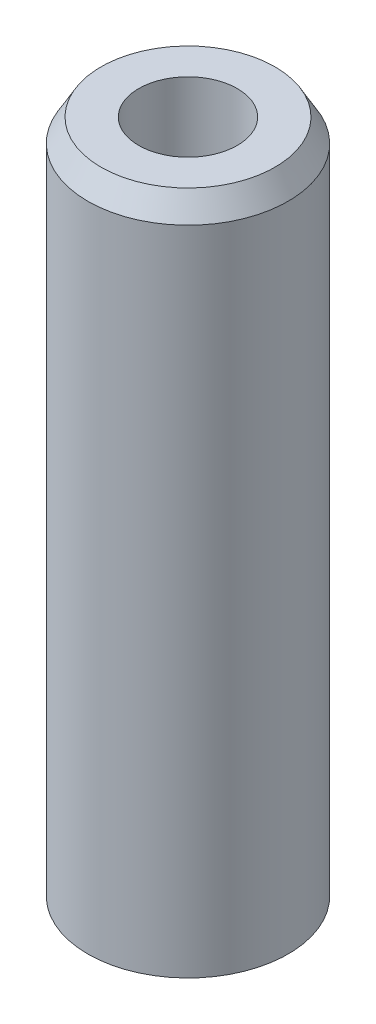
ISO-10303-21;
HEADER;
FILE_DESCRIPTION(('STEP AP214'),'2;1');
FILE_NAME('part.step','',(''),(''),'','','');
FILE_SCHEMA(('AUTOMOTIVE_DESIGN { 1 0 10303 214 1 1 1 1 }'));
ENDSEC;
DATA;
#1=APPLICATION_CONTEXT('core data for automotive mechanical design processes');
#2=APPLICATION_PROTOCOL_DEFINITION('international standard','automotive_design',2000,#1);
#3=PRODUCT_CONTEXT('',#1,'mechanical');
#4=PRODUCT('Part','Part','',(#3));
#5=PRODUCT_RELATED_PRODUCT_CATEGORY('part','',(#4));
#6=PRODUCT_DEFINITION_FORMATION('','',#4);
#7=PRODUCT_DEFINITION_CONTEXT('part definition',#1,'design');
#8=PRODUCT_DEFINITION('design','',#6,#7);
#9=PRODUCT_DEFINITION_SHAPE('','',#8);
#10=(LENGTH_UNIT() NAMED_UNIT(*) SI_UNIT(.MILLI.,.METRE.));
#11=(NAMED_UNIT(*) PLANE_ANGLE_UNIT() SI_UNIT($,.RADIAN.));
#12=(NAMED_UNIT(*) SI_UNIT($,.STERADIAN.) SOLID_ANGLE_UNIT());
#13=UNCERTAINTY_MEASURE_WITH_UNIT(LENGTH_MEASURE(1.E-05),#10,'distance_accuracy_value','');
#14=(GEOMETRIC_REPRESENTATION_CONTEXT(3) GLOBAL_UNCERTAINTY_ASSIGNED_CONTEXT((#13)) GLOBAL_UNIT_ASSIGNED_CONTEXT((#10,
#11,#12)) REPRESENTATION_CONTEXT('',''));
#15=CARTESIAN_POINT('',(0.,0.,0.));
#16=DIRECTION('',(0.,0.,1.));
#17=DIRECTION('',(1.,0.,0.));
#18=AXIS2_PLACEMENT_3D('',#15,#16,#17);
#19=CARTESIAN_POINT('',(0.,102.994844138069,0.));
#20=DIRECTION('',(0.,-1.,0.));
#21=DIRECTION('',(0.,0.,-1.));
#22=AXIS2_PLACEMENT_3D('',#19,#20,#21);
#23=CYLINDRICAL_SURFACE('',#22,15.);
#24=CARTESIAN_POINT('',(0.,99.5692239105849,0.));
#25=DIRECTION('',(0.,1.,0.));
#26=DIRECTION('',(0.,0.,1.));
#27=AXIS2_PLACEMENT_3D('',#24,#25,#26);
#28=CIRCLE('',#27,15.);
#29=CARTESIAN_POINT('',(0.,99.5692239105849,-15.));
#30=VERTEX_POINT('',#29);
#31=EDGE_CURVE('E50',#30,#30,#28,.F.);
#32=CARTESIAN_POINT('',(0.,1.97778276047943,0.));
#33=DIRECTION('',(0.,1.,0.));
#34=DIRECTION('',(0.,0.,1.));
#35=AXIS2_PLACEMENT_3D('',#32,#33,#34);
#36=CIRCLE('',#35,15.);
#37=CARTESIAN_POINT('',(0.,1.97778276047941,-15.));
#38=VERTEX_POINT('',#37);
#39=EDGE_CURVE('E51',#38,#38,#36,.T.);
#40=CARTESIAN_POINT('',(0.,99.5692239105849,-15.));
#41=CARTESIAN_POINT('',(0.,98.5526463986047,-15.));
#42=CARTESIAN_POINT('',(0.,97.5360688866244,-15.));
#43=CARTESIAN_POINT('',(0.,95.5029138626639,-15.));
#44=CARTESIAN_POINT('',(0.,94.4863363506836,-15.));
#45=CARTESIAN_POINT('',(0.,92.4531813267231,-15.));
#46=CARTESIAN_POINT('',(0.,91.4366038147428,-15.));
#47=CARTESIAN_POINT('',(0.,89.4034487907823,-15.));
#48=CARTESIAN_POINT('',(0.,88.386871278802,-15.));
#49=CARTESIAN_POINT('',(0.,86.3537162548415,-15.));
#50=CARTESIAN_POINT('',(0.,85.3371387428612,-15.));
#51=CARTESIAN_POINT('',(0.,83.3039837189007,-15.));
#52=CARTESIAN_POINT('',(0.,82.2874062069204,-15.));
#53=CARTESIAN_POINT('',(0.,80.2542511829599,-15.));
#54=CARTESIAN_POINT('',(0.,79.2376736709796,-15.));
#55=CARTESIAN_POINT('',(0.,77.2045186470191,-15.));
#56=CARTESIAN_POINT('',(0.,76.1879411350388,-15.));
#57=CARTESIAN_POINT('',(0.,74.1547861110783,-15.));
#58=CARTESIAN_POINT('',(0.,73.138208599098,-15.));
#59=CARTESIAN_POINT('',(0.,71.1050535751375,-15.));
#60=CARTESIAN_POINT('',(0.,70.0884760631572,-15.));
#61=CARTESIAN_POINT('',(0.,68.0553210391967,-15.));
#62=CARTESIAN_POINT('',(0.,67.0387435272164,-15.));
#63=CARTESIAN_POINT('',(0.,65.0055885032559,-15.));
#64=CARTESIAN_POINT('',(0.,63.9890109912756,-15.));
#65=CARTESIAN_POINT('',(0.,61.9558559673151,-15.));
#66=CARTESIAN_POINT('',(0.,60.9392784553348,-15.));
#67=CARTESIAN_POINT('',(0.,58.9061234313743,-15.));
#68=CARTESIAN_POINT('',(0.,57.889545919394,-15.));
#69=CARTESIAN_POINT('',(0.,55.8563908954335,-15.));
#70=CARTESIAN_POINT('',(0.,54.8398133834532,-15.));
#71=CARTESIAN_POINT('',(0.,52.8066583594927,-15.));
#72=CARTESIAN_POINT('',(0.,51.7900808475124,-15.));
#73=CARTESIAN_POINT('',(0.,49.7569258235519,-15.));
#74=CARTESIAN_POINT('',(0.,48.7403483115716,-15.));
#75=CARTESIAN_POINT('',(0.,46.7071932876111,-15.));
#76=CARTESIAN_POINT('',(0.,45.6906157756308,-15.));
#77=CARTESIAN_POINT('',(0.,43.6574607516703,-15.));
#78=CARTESIAN_POINT('',(0.,42.64088323969,-15.));
#79=CARTESIAN_POINT('',(0.,40.6077282157295,-15.));
#80=CARTESIAN_POINT('',(0.,39.5911507037492,-15.));
#81=CARTESIAN_POINT('',(0.,37.5579956797887,-15.));
#82=CARTESIAN_POINT('',(0.,36.5414181678085,-15.));
#83=CARTESIAN_POINT('',(0.,34.5082631438479,-15.));
#84=CARTESIAN_POINT('',(0.,33.4916856318677,-15.));
#85=CARTESIAN_POINT('',(0.,31.4585306079071,-15.));
#86=CARTESIAN_POINT('',(0.,30.4419530959269,-15.));
#87=CARTESIAN_POINT('',(0.,28.4087980719663,-15.));
#88=CARTESIAN_POINT('',(0.,27.3922205599861,-15.));
#89=CARTESIAN_POINT('',(0.,25.3590655360255,-15.));
#90=CARTESIAN_POINT('',(0.,24.3424880240453,-15.));
#91=CARTESIAN_POINT('',(0.,22.3093330000847,-15.));
#92=CARTESIAN_POINT('',(0.,21.2927554881045,-15.));
#93=CARTESIAN_POINT('',(0.,19.2596004641439,-15.));
#94=CARTESIAN_POINT('',(0.,18.2430229521637,-15.));
#95=CARTESIAN_POINT('',(0.,16.2098679282031,-15.));
#96=CARTESIAN_POINT('',(0.,15.1932904162229,-15.));
#97=CARTESIAN_POINT('',(0.,13.1601353922623,-15.));
#98=CARTESIAN_POINT('',(0.,12.1435578802821,-15.));
#99=CARTESIAN_POINT('',(0.,10.1104028563215,-15.));
#100=CARTESIAN_POINT('',(0.,9.09382534434127,-15.));
#101=CARTESIAN_POINT('',(0.,7.06067032038073,-15.));
#102=CARTESIAN_POINT('',(0.,6.04409280840047,-15.));
#103=CARTESIAN_POINT('',(0.,4.01093778443994,-15.));
#104=CARTESIAN_POINT('',(0.,2.99436027245968,-15.));
#105=CARTESIAN_POINT('',(0.,1.97778276047941,-15.));
#106=B_SPLINE_CURVE_WITH_KNOTS('',3,(#40,#41,#42,#43,#44,#45,#46,#47,#48,#49,#50,#51,#52,#53,
#54,#55,#56,#57,#58,#59,#60,#61,#62,#63,#64,#65,#66,#67,#68,#69,#70,#71,#72,#73,#74,#75,#76,#77,
#78,#79,#80,#81,#82,#83,#84,#85,#86,#87,#88,#89,#90,#91,#92,#93,#94,#95,#96,#97,#98,#99,#100,
#101,#102,#103,#104,#105),.UNSPECIFIED.,.F.,.F.,(4,2,2,2,2,2,2,2,2,2,2,2,2,2,2,2,2,2,2,2,2,2,2,
2,2,2,2,2,2,2,2,2,4),(0.,3.04973253594081,6.0994650718816,9.1491976078224,12.1989301437632,
15.248662679704,18.2983952156448,21.3481277515856,24.3978602875264,27.4475928234672,
30.497325359408,33.5470578953488,36.5967904312896,39.6465229672304,42.6962555031712,
45.745988039112,48.7957205750528,51.8454531109936,54.8951856469344,57.9449181828752,
60.9946507188159,64.0443832547567,67.0941157906976,70.1438483266383,73.1935808625791,
76.2433133985199,79.2930459344607,82.3427784704015,85.3925110063423,88.4422435422831,
91.4919760782239,94.5417086141647,97.5914411501055),.UNSPECIFIED.);
#107=EDGE_CURVE('BSEAM39',#30,#38,#106,.T.);
#108=ORIENTED_EDGE('',*,*,#31,.T.);
#109=ORIENTED_EDGE('',*,*,#39,.T.);
#110=ORIENTED_EDGE('',*,*,#107,.T.);
#111=ORIENTED_EDGE('',*,*,#107,.F.);
#112=EDGE_LOOP('',(#108,#110,#109,#111));
#113=FACE_BOUND('',#112,.T.);
#114=ADVANCED_FACE('F39',(#113),#23,.T.);
#115=CARTESIAN_POINT('',(0.,102.994844138069,0.));
#116=DIRECTION('',(0.,1.,0.));
#117=DIRECTION('',(0.,0.,1.));
#118=AXIS2_PLACEMENT_3D('',#115,#116,#117);
#119=PLANE('',#118);
#120=CARTESIAN_POINT('',(0.,102.994844138069,0.));
#121=DIRECTION('',(0.,1.,0.));
#122=DIRECTION('',(0.,0.,1.));
#123=AXIS2_PLACEMENT_3D('',#120,#121,#122);
#124=CIRCLE('',#123,13.0222172395207);
#125=CARTESIAN_POINT('',(0.,102.994844138069,13.0222172395207));
#126=VERTEX_POINT('',#125);
#127=EDGE_CURVE('E54',#126,#126,#124,.T.);
#128=ORIENTED_EDGE('',*,*,#127,.T.);
#129=EDGE_LOOP('',(#128));
#130=FACE_BOUND('',#129,.T.);
#131=CARTESIAN_POINT('',(0.,102.994844138069,0.));
#132=DIRECTION('',(0.,1.,0.));
#133=DIRECTION('',(0.,0.,1.));
#134=AXIS2_PLACEMENT_3D('',#131,#132,#133);
#135=CIRCLE('',#134,7.38051946194421);
#136=CARTESIAN_POINT('',(0.,102.994844138069,-7.38051946194421));
#137=VERTEX_POINT('',#136);
#138=EDGE_CURVE('E58',#137,#137,#135,.T.);
#139=ORIENTED_EDGE('',*,*,#138,.F.);
#140=EDGE_LOOP('',(#139));
#141=FACE_BOUND('',#140,.T.);
#142=ADVANCED_FACE('F69',(#130,#141),#119,.T.);
#143=CARTESIAN_POINT('',(0.,0.,0.));
#144=DIRECTION('',(0.,1.,0.));
#145=DIRECTION('',(0.,0.,1.));
#146=AXIS2_PLACEMENT_3D('',#143,#144,#145);
#147=PLANE('',#146);
#148=CARTESIAN_POINT('',(0.,0.,0.));
#149=DIRECTION('',(0.,1.,0.));
#150=DIRECTION('',(0.,0.,1.));
#151=AXIS2_PLACEMENT_3D('',#148,#149,#150);
#152=CIRCLE('',#151,11.5743797725158);
#153=CARTESIAN_POINT('',(0.,0.,11.5743797725158));
#154=VERTEX_POINT('',#153);
#155=EDGE_CURVE('E10',#154,#154,#152,.F.);
#156=ORIENTED_EDGE('',*,*,#155,.T.);
#157=EDGE_LOOP('',(#156));
#158=FACE_BOUND('',#157,.T.);
#159=CARTESIAN_POINT('',(0.,0.,0.));
#160=DIRECTION('',(0.,1.,0.));
#161=DIRECTION('',(0.,0.,1.));
#162=AXIS2_PLACEMENT_3D('',#159,#160,#161);
#163=CIRCLE('',#162,7.38051946194421);
#164=CARTESIAN_POINT('',(0.,0.,-7.38051946194421));
#165=VERTEX_POINT('',#164);
#166=EDGE_CURVE('E63',#165,#165,#163,.T.);
#167=ORIENTED_EDGE('',*,*,#166,.T.);
#168=EDGE_LOOP('',(#167));
#169=FACE_BOUND('',#168,.T.);
#170=ADVANCED_FACE('F75',(#158,#169),#147,.F.);
#171=CARTESIAN_POINT('',(0.,102.994844138069,0.));
#172=DIRECTION('',(0.,-1.,0.));
#173=DIRECTION('',(0.,0.,-1.));
#174=AXIS2_PLACEMENT_3D('',#171,#172,#173);
#175=CYLINDRICAL_SURFACE('',#174,7.38051946194421);
#176=CARTESIAN_POINT('',(0.,102.994844138069,-7.38051946194421));
#177=CARTESIAN_POINT('',(0.,101.921981178297,-7.38051946194421));
#178=CARTESIAN_POINT('',(0.,100.849118218526,-7.38051946194421));
#179=CARTESIAN_POINT('',(0.,98.7033922989828,-7.38051946194421));
#180=CARTESIAN_POINT('',(0.,97.6305293392112,-7.38051946194421));
#181=CARTESIAN_POINT('',(0.,95.4848034196681,-7.38051946194421));
#182=CARTESIAN_POINT('',(0.,94.4119404598966,-7.38051946194421));
#183=CARTESIAN_POINT('',(0.,92.2662145403535,-7.38051946194421));
#184=CARTESIAN_POINT('',(0.,91.1933515805819,-7.38051946194421));
#185=CARTESIAN_POINT('',(0.,89.0476256610388,-7.38051946194421));
#186=CARTESIAN_POINT('',(0.,87.9747627012673,-7.38051946194421));
#187=CARTESIAN_POINT('',(0.,85.8290367817242,-7.38051946194421));
#188=CARTESIAN_POINT('',(0.,84.7561738219526,-7.38051946194421));
#189=CARTESIAN_POINT('',(0.,82.6104479024095,-7.38051946194421));
#190=CARTESIAN_POINT('',(0.,81.5375849426379,-7.38051946194421));
#191=CARTESIAN_POINT('',(0.,79.3918590230948,-7.38051946194421));
#192=CARTESIAN_POINT('',(0.,78.3189960633233,-7.38051946194421));
#193=CARTESIAN_POINT('',(0.,76.1732701437802,-7.38051946194421));
#194=CARTESIAN_POINT('',(0.,75.1004071840086,-7.38051946194421));
#195=CARTESIAN_POINT('',(0.,72.9546812644655,-7.38051946194421));
#196=CARTESIAN_POINT('',(0.,71.881818304694,-7.38051946194421));
#197=CARTESIAN_POINT('',(0.,69.7360923851509,-7.38051946194421));
#198=CARTESIAN_POINT('',(0.,68.6632294253793,-7.38051946194421));
#199=CARTESIAN_POINT('',(0.,66.5175035058362,-7.38051946194421));
#200=CARTESIAN_POINT('',(0.,65.4446405460647,-7.38051946194421));
#201=CARTESIAN_POINT('',(0.,63.2989146265216,-7.38051946194421));
#202=CARTESIAN_POINT('',(0.,62.22605166675,-7.38051946194421));
#203=CARTESIAN_POINT('',(0.,60.0803257472069,-7.38051946194421));
#204=CARTESIAN_POINT('',(0.,59.0074627874354,-7.38051946194421));
#205=CARTESIAN_POINT('',(0.,56.8617368678922,-7.38051946194421));
#206=CARTESIAN_POINT('',(0.,55.7888739081207,-7.38051946194421));
#207=CARTESIAN_POINT('',(0.,53.6431479885776,-7.38051946194421));
#208=CARTESIAN_POINT('',(0.,52.570285028806,-7.38051946194421));
#209=CARTESIAN_POINT('',(0.,50.4245591092629,-7.38051946194421));
#210=CARTESIAN_POINT('',(0.,49.3516961494914,-7.38051946194421));
#211=CARTESIAN_POINT('',(0.,47.2059702299483,-7.38051946194421));
#212=CARTESIAN_POINT('',(0.,46.1331072701767,-7.38051946194421));
#213=CARTESIAN_POINT('',(0.,43.9873813506336,-7.38051946194421));
#214=CARTESIAN_POINT('',(0.,42.9145183908621,-7.38051946194421));
#215=CARTESIAN_POINT('',(0.,40.768792471319,-7.38051946194421));
#216=CARTESIAN_POINT('',(0.,39.6959295115474,-7.38051946194421));
#217=CARTESIAN_POINT('',(0.,37.5502035920043,-7.38051946194421));
#218=CARTESIAN_POINT('',(0.,36.4773406322328,-7.38051946194421));
#219=CARTESIAN_POINT('',(0.,34.3316147126897,-7.38051946194421));
#220=CARTESIAN_POINT('',(0.,33.2587517529181,-7.38051946194421));
#221=CARTESIAN_POINT('',(0.,31.113025833375,-7.38051946194421));
#222=CARTESIAN_POINT('',(0.,30.0401628736035,-7.38051946194421));
#223=CARTESIAN_POINT('',(0.,27.8944369540604,-7.38051946194421));
#224=CARTESIAN_POINT('',(0.,26.8215739942888,-7.38051946194421));
#225=CARTESIAN_POINT('',(0.,24.6758480747457,-7.38051946194421));
#226=CARTESIAN_POINT('',(0.,23.6029851149742,-7.38051946194421));
#227=CARTESIAN_POINT('',(0.,21.457259195431,-7.38051946194421));
#228=CARTESIAN_POINT('',(0.,20.3843962356595,-7.38051946194421));
#229=CARTESIAN_POINT('',(0.,18.2386703161164,-7.38051946194421));
#230=CARTESIAN_POINT('',(0.,17.1658073563448,-7.38051946194421));
#231=CARTESIAN_POINT('',(0.,15.0200814368017,-7.38051946194421));
#232=CARTESIAN_POINT('',(0.,13.9472184770302,-7.38051946194421));
#233=CARTESIAN_POINT('',(0.,11.8014925574871,-7.38051946194421));
#234=CARTESIAN_POINT('',(0.,10.7286295977155,-7.38051946194421));
#235=CARTESIAN_POINT('',(0.,8.58290367817242,-7.38051946194421));
#236=CARTESIAN_POINT('',(0.,7.51004071840087,-7.38051946194421));
#237=CARTESIAN_POINT('',(0.,5.36431479885776,-7.38051946194421));
#238=CARTESIAN_POINT('',(0.,4.29145183908621,-7.38051946194421));
#239=CARTESIAN_POINT('',(0.,2.1457259195431,-7.38051946194421));
#240=CARTESIAN_POINT('',(0.,1.07286295977155,-7.38051946194421));
#241=CARTESIAN_POINT('',(0.,0.,-7.38051946194421));
#242=B_SPLINE_CURVE_WITH_KNOTS('',3,(#176,#177,#178,#179,#180,#181,#182,#183,#184,#185,#186,
#187,#188,#189,#190,#191,#192,#193,#194,#195,#196,#197,#198,#199,#200,#201,#202,#203,#204,#205,
#206,#207,#208,#209,#210,#211,#212,#213,#214,#215,#216,#217,#218,#219,#220,#221,#222,#223,#224,
#225,#226,#227,#228,#229,#230,#231,#232,#233,#234,#235,#236,#237,#238,#239,#240,#241),
.UNSPECIFIED.,.F.,.F.,(4,2,2,2,2,2,2,2,2,2,2,2,2,2,2,2,2,2,2,2,2,2,2,2,2,2,2,2,2,2,2,2,4),(0.,
3.21858887931466,6.43717775862931,9.65576663794397,12.8743555172586,16.0929443965733,
19.3115332758879,22.5301221552026,25.7487110345173,28.9672999138319,32.1858887931466,
35.4044776724612,38.6230665517759,41.8416554310905,45.0602443104052,48.2788331897198,
51.4974220690345,54.7160109483492,57.9345998276638,61.1531887069785,64.3717775862931,
67.5903664656078,70.8089553449224,74.0275442242371,77.2461331035517,80.4647219828664,
83.683310862181,86.9018997414957,90.1204886208104,93.339077500125,96.5576663794397,
99.7762552587543,102.994844138069),.UNSPECIFIED.);
#243=EDGE_CURVE('BSEAM70',#137,#165,#242,.T.);
#244=ORIENTED_EDGE('',*,*,#138,.T.);
#245=ORIENTED_EDGE('',*,*,#166,.F.);
#246=ORIENTED_EDGE('',*,*,#243,.T.);
#247=ORIENTED_EDGE('',*,*,#243,.F.);
#248=EDGE_LOOP('',(#244,#246,#245,#247));
#249=FACE_BOUND('',#248,.T.);
#250=ADVANCED_FACE('F70',(#249),#175,.F.);
#251=CARTESIAN_POINT('',(0.,102.994844138069,0.));
#252=DIRECTION('',(0.,-1.,0.));
#253=DIRECTION('',(0.,0.,-1.));
#254=AXIS2_PLACEMENT_3D('',#251,#252,#253);
#255=CONICAL_SURFACE('',#254,13.0222172395207,0.523598775598295);
#256=ORIENTED_EDGE('',*,*,#31,.F.);
#257=EDGE_LOOP('',(#256));
#258=FACE_BOUND('',#257,.T.);
#259=ORIENTED_EDGE('',*,*,#127,.F.);
#260=EDGE_LOOP('',(#259));
#261=FACE_BOUND('',#260,.T.);
#262=ADVANCED_FACE('F81',(#258,#261),#255,.T.);
#263=CARTESIAN_POINT('',(0.,1.97778276047943,0.));
#264=DIRECTION('',(0.,1.,0.));
#265=DIRECTION('',(0.,0.,1.));
#266=AXIS2_PLACEMENT_3D('',#263,#264,#265);
#267=CONICAL_SURFACE('',#266,15.,1.0471975511966);
#268=ORIENTED_EDGE('',*,*,#155,.F.);
#269=EDGE_LOOP('',(#268));
#270=FACE_BOUND('',#269,.T.);
#271=ORIENTED_EDGE('',*,*,#39,.F.);
#272=EDGE_LOOP('',(#271));
#273=FACE_BOUND('',#272,.T.);
#274=ADVANCED_FACE('F45',(#270,#273),#267,.T.);
#275=CLOSED_SHELL('',(#114,#142,#170,#250,#262,#274));
#276=MANIFOLD_SOLID_BREP('B2',#275);
#277=ADVANCED_BREP_SHAPE_REPRESENTATION('',(#18,#276),#14);
#278=SHAPE_DEFINITION_REPRESENTATION(#9,#277);
ENDSEC;
END-ISO-10303-21;
